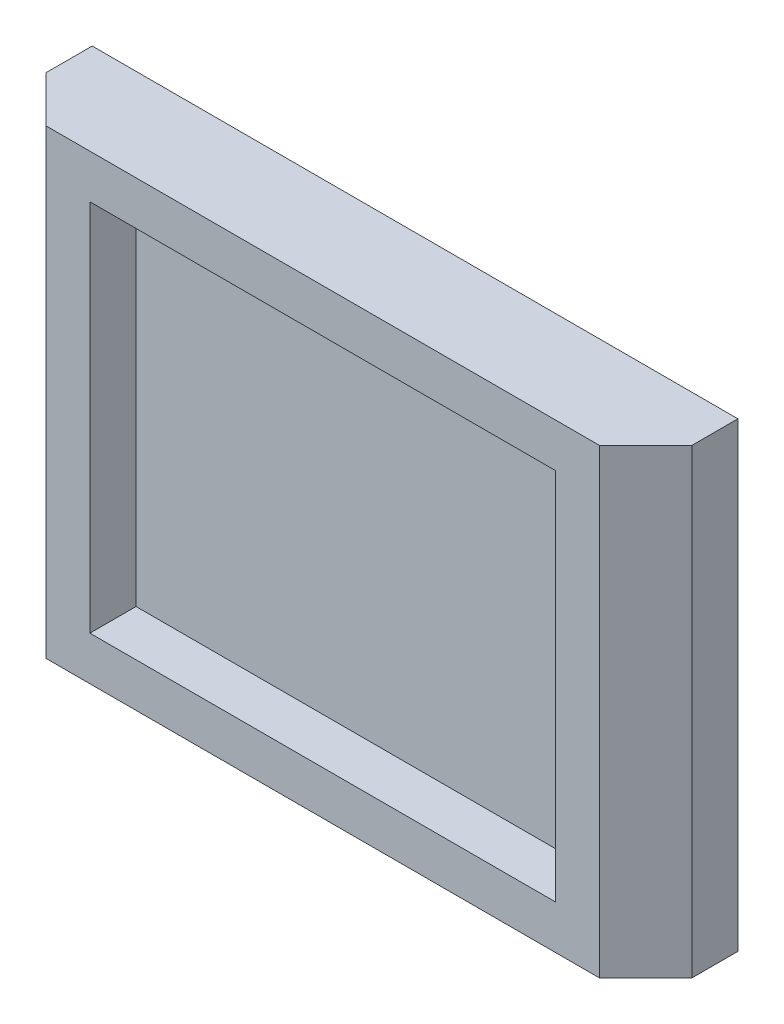
ISO-10303-21;
HEADER;
FILE_DESCRIPTION(('STEP AP214'),'2;1');
FILE_NAME('part.step','',(''),(''),'','','');
FILE_SCHEMA(('AUTOMOTIVE_DESIGN { 1 0 10303 214 1 1 1 1 }'));
ENDSEC;
DATA;
#1=APPLICATION_CONTEXT('core data for automotive mechanical design processes');
#2=APPLICATION_PROTOCOL_DEFINITION('international standard','automotive_design',2000,#1);
#3=PRODUCT_CONTEXT('',#1,'mechanical');
#4=PRODUCT('Part','Part','',(#3));
#5=PRODUCT_RELATED_PRODUCT_CATEGORY('part','',(#4));
#6=PRODUCT_DEFINITION_FORMATION('','',#4);
#7=PRODUCT_DEFINITION_CONTEXT('part definition',#1,'design');
#8=PRODUCT_DEFINITION('design','',#6,#7);
#9=PRODUCT_DEFINITION_SHAPE('','',#8);
#10=(LENGTH_UNIT() NAMED_UNIT(*) SI_UNIT(.MILLI.,.METRE.));
#11=(NAMED_UNIT(*) PLANE_ANGLE_UNIT() SI_UNIT($,.RADIAN.));
#12=(NAMED_UNIT(*) SI_UNIT($,.STERADIAN.) SOLID_ANGLE_UNIT());
#13=UNCERTAINTY_MEASURE_WITH_UNIT(LENGTH_MEASURE(1.E-05),#10,'distance_accuracy_value','');
#14=(GEOMETRIC_REPRESENTATION_CONTEXT(3) GLOBAL_UNCERTAINTY_ASSIGNED_CONTEXT((#13)) GLOBAL_UNIT_ASSIGNED_CONTEXT((#10,
#11,#12)) REPRESENTATION_CONTEXT('',''));
#15=CARTESIAN_POINT('',(0.,0.,0.));
#16=DIRECTION('',(0.,0.,1.));
#17=DIRECTION('',(1.,0.,0.));
#18=AXIS2_PLACEMENT_3D('',#15,#16,#17);
#19=CARTESIAN_POINT('',(-35.,25.,10.));
#20=DIRECTION('',(1.,0.,0.));
#21=DIRECTION('',(0.,1.,0.));
#22=AXIS2_PLACEMENT_3D('',#19,#20,#21);
#23=PLANE('',#22);
#24=DIRECTION('',(0.,0.,-1.));
#25=VECTOR('',#24,1.);
#26=CARTESIAN_POINT('',(-35.,-25.,10.));
#27=LINE('',#26,#25);
#28=CARTESIAN_POINT('',(-35.,-25.,4.99999999999997));
#29=VERTEX_POINT('',#28);
#30=CARTESIAN_POINT('',(-35.,-25.,0.));
#31=VERTEX_POINT('',#30);
#32=EDGE_CURVE('E207',#29,#31,#27,.T.);
#33=ORIENTED_EDGE('',*,*,#32,.F.);
#34=DIRECTION('',(0.,1.,0.));
#35=VECTOR('',#34,1.);
#36=CARTESIAN_POINT('',(-35.,25.,4.99999999999997));
#37=LINE('',#36,#35);
#38=CARTESIAN_POINT('',(-35.,25.,4.99999999999997));
#39=VERTEX_POINT('',#38);
#40=EDGE_CURVE('E66',#29,#39,#37,.T.);
#41=ORIENTED_EDGE('',*,*,#40,.T.);
#42=DIRECTION('',(0.,0.,-1.));
#43=VECTOR('',#42,1.);
#44=CARTESIAN_POINT('',(-35.,25.,10.));
#45=LINE('',#44,#43);
#46=CARTESIAN_POINT('',(-35.,25.,0.));
#47=VERTEX_POINT('',#46);
#48=EDGE_CURVE('E184',#39,#47,#45,.T.);
#49=ORIENTED_EDGE('',*,*,#48,.T.);
#50=DIRECTION('',(0.,-1.,0.));
#51=VECTOR('',#50,1.);
#52=CARTESIAN_POINT('',(-35.,25.,0.));
#53=LINE('',#52,#51);
#54=EDGE_CURVE('E169',#47,#31,#53,.T.);
#55=ORIENTED_EDGE('',*,*,#54,.T.);
#56=EDGE_LOOP('',(#33,#41,#49,#55));
#57=FACE_BOUND('',#56,.T.);
#58=ADVANCED_FACE('F41',(#57),#23,.F.);
#59=CARTESIAN_POINT('',(-35.,-25.,10.));
#60=DIRECTION('',(0.,1.,0.));
#61=DIRECTION('',(-1.,0.,0.));
#62=AXIS2_PLACEMENT_3D('',#59,#60,#61);
#63=PLANE('',#62);
#64=DIRECTION('',(1.,0.,0.));
#65=VECTOR('',#64,1.);
#66=CARTESIAN_POINT('',(-35.,-25.,10.));
#67=LINE('',#66,#65);
#68=CARTESIAN_POINT('',(-30.,-25.,10.));
#69=VERTEX_POINT('',#68);
#70=CARTESIAN_POINT('',(30.,-25.,10.));
#71=VERTEX_POINT('',#70);
#72=EDGE_CURVE('E175',#69,#71,#67,.T.);
#73=ORIENTED_EDGE('',*,*,#72,.F.);
#74=DIRECTION('',(-0.707106781186546,0.,-0.707106781186549));
#75=VECTOR('',#74,1.);
#76=CARTESIAN_POINT('',(-30.,-25.,10.));
#77=LINE('',#76,#75);
#78=EDGE_CURVE('E221',#69,#29,#77,.T.);
#79=ORIENTED_EDGE('',*,*,#78,.T.);
#80=ORIENTED_EDGE('',*,*,#32,.T.);
#81=DIRECTION('',(1.,0.,0.));
#82=VECTOR('',#81,1.);
#83=CARTESIAN_POINT('',(-35.,-25.,0.));
#84=LINE('',#83,#82);
#85=CARTESIAN_POINT('',(35.,-25.,0.));
#86=VERTEX_POINT('',#85);
#87=EDGE_CURVE('E188',#31,#86,#84,.T.);
#88=ORIENTED_EDGE('',*,*,#87,.T.);
#89=DIRECTION('',(0.,0.,-1.));
#90=VECTOR('',#89,1.);
#91=CARTESIAN_POINT('',(35.,-25.,10.));
#92=LINE('',#91,#90);
#93=CARTESIAN_POINT('',(35.,-25.,4.99999999999997));
#94=VERTEX_POINT('',#93);
#95=EDGE_CURVE('E204',#94,#86,#92,.T.);
#96=ORIENTED_EDGE('',*,*,#95,.F.);
#97=DIRECTION('',(-0.707106781186546,0.,0.707106781186549));
#98=VECTOR('',#97,1.);
#99=CARTESIAN_POINT('',(30.,-25.,10.));
#100=LINE('',#99,#98);
#101=EDGE_CURVE('E218',#94,#71,#100,.T.);
#102=ORIENTED_EDGE('',*,*,#101,.T.);
#103=EDGE_LOOP('',(#73,#79,#80,#88,#96,#102));
#104=FACE_BOUND('',#103,.T.);
#105=ADVANCED_FACE('F238',(#104),#63,.F.);
#106=CARTESIAN_POINT('',(35.,25.,10.));
#107=DIRECTION('',(-1.,0.,0.));
#108=DIRECTION('',(0.,-1.,0.));
#109=AXIS2_PLACEMENT_3D('',#106,#107,#108);
#110=PLANE('',#109);
#111=DIRECTION('',(0.,0.,-1.));
#112=VECTOR('',#111,1.);
#113=CARTESIAN_POINT('',(35.,25.,10.));
#114=LINE('',#113,#112);
#115=CARTESIAN_POINT('',(35.,25.,4.99999999999997));
#116=VERTEX_POINT('',#115);
#117=CARTESIAN_POINT('',(35.,25.,0.));
#118=VERTEX_POINT('',#117);
#119=EDGE_CURVE('E201',#116,#118,#114,.T.);
#120=ORIENTED_EDGE('',*,*,#119,.F.);
#121=DIRECTION('',(0.,-1.,0.));
#122=VECTOR('',#121,1.);
#123=CARTESIAN_POINT('',(35.,-25.,4.99999999999997));
#124=LINE('',#123,#122);
#125=EDGE_CURVE('E11',#116,#94,#124,.T.);
#126=ORIENTED_EDGE('',*,*,#125,.T.);
#127=ORIENTED_EDGE('',*,*,#95,.T.);
#128=DIRECTION('',(0.,1.,0.));
#129=VECTOR('',#128,1.);
#130=CARTESIAN_POINT('',(35.,25.,0.));
#131=LINE('',#130,#129);
#132=EDGE_CURVE('E192',#86,#118,#131,.T.);
#133=ORIENTED_EDGE('',*,*,#132,.T.);
#134=EDGE_LOOP('',(#120,#126,#127,#133));
#135=FACE_BOUND('',#134,.T.);
#136=ADVANCED_FACE('F250',(#135),#110,.F.);
#137=CARTESIAN_POINT('',(-35.,25.,10.));
#138=DIRECTION('',(0.,-1.,0.));
#139=DIRECTION('',(1.,0.,0.));
#140=AXIS2_PLACEMENT_3D('',#137,#138,#139);
#141=PLANE('',#140);
#142=ORIENTED_EDGE('',*,*,#48,.F.);
#143=DIRECTION('',(0.707106781186546,0.,0.707106781186549));
#144=VECTOR('',#143,1.);
#145=CARTESIAN_POINT('',(-30.,25.,10.));
#146=LINE('',#145,#144);
#147=CARTESIAN_POINT('',(-30.,25.,10.));
#148=VERTEX_POINT('',#147);
#149=EDGE_CURVE('E51',#39,#148,#146,.T.);
#150=ORIENTED_EDGE('',*,*,#149,.T.);
#151=DIRECTION('',(-1.,0.,0.));
#152=VECTOR('',#151,1.);
#153=CARTESIAN_POINT('',(-35.,25.,10.));
#154=LINE('',#153,#152);
#155=CARTESIAN_POINT('',(30.,25.,10.));
#156=VERTEX_POINT('',#155);
#157=EDGE_CURVE('E179',#156,#148,#154,.T.);
#158=ORIENTED_EDGE('',*,*,#157,.F.);
#159=DIRECTION('',(0.707106781186546,0.,-0.707106781186549));
#160=VECTOR('',#159,1.);
#161=CARTESIAN_POINT('',(30.,25.,9.99999999999999));
#162=LINE('',#161,#160);
#163=EDGE_CURVE('E58',#156,#116,#162,.T.);
#164=ORIENTED_EDGE('',*,*,#163,.T.);
#165=ORIENTED_EDGE('',*,*,#119,.T.);
#166=DIRECTION('',(-1.,0.,0.));
#167=VECTOR('',#166,1.);
#168=CARTESIAN_POINT('',(-35.,25.,0.));
#169=LINE('',#168,#167);
#170=EDGE_CURVE('E180',#118,#47,#169,.T.);
#171=ORIENTED_EDGE('',*,*,#170,.T.);
#172=EDGE_LOOP('',(#142,#150,#158,#164,#165,#171));
#173=FACE_BOUND('',#172,.T.);
#174=ADVANCED_FACE('F229',(#173),#141,.F.);
#175=CARTESIAN_POINT('',(0.,0.,10.));
#176=DIRECTION('',(0.,0.,1.));
#177=DIRECTION('',(1.,0.,0.));
#178=AXIS2_PLACEMENT_3D('',#175,#176,#177);
#179=PLANE('',#178);
#180=DIRECTION('',(0.,-1.,0.));
#181=VECTOR('',#180,1.);
#182=CARTESIAN_POINT('',(-25.25,20.25,10.));
#183=LINE('',#182,#181);
#184=CARTESIAN_POINT('',(-25.25,20.25,10.));
#185=VERTEX_POINT('',#184);
#186=CARTESIAN_POINT('',(-25.25,-20.25,10.));
#187=VERTEX_POINT('',#186);
#188=EDGE_CURVE('E127',#185,#187,#183,.T.);
#189=ORIENTED_EDGE('',*,*,#188,.F.);
#190=DIRECTION('',(-1.,0.,0.));
#191=VECTOR('',#190,1.);
#192=CARTESIAN_POINT('',(-25.25,20.25,10.));
#193=LINE('',#192,#191);
#194=CARTESIAN_POINT('',(25.25,20.25,10.));
#195=VERTEX_POINT('',#194);
#196=EDGE_CURVE('E147',#195,#185,#193,.T.);
#197=ORIENTED_EDGE('',*,*,#196,.F.);
#198=DIRECTION('',(0.,1.,0.));
#199=VECTOR('',#198,1.);
#200=CARTESIAN_POINT('',(25.25,20.25,10.));
#201=LINE('',#200,#199);
#202=CARTESIAN_POINT('',(25.25,-20.25,10.));
#203=VERTEX_POINT('',#202);
#204=EDGE_CURVE('E151',#203,#195,#201,.T.);
#205=ORIENTED_EDGE('',*,*,#204,.F.);
#206=DIRECTION('',(1.,0.,0.));
#207=VECTOR('',#206,1.);
#208=CARTESIAN_POINT('',(-25.25,-20.25,10.));
#209=LINE('',#208,#207);
#210=EDGE_CURVE('E160',#187,#203,#209,.T.);
#211=ORIENTED_EDGE('',*,*,#210,.F.);
#212=EDGE_LOOP('',(#189,#197,#205,#211));
#213=FACE_BOUND('',#212,.T.);
#214=ORIENTED_EDGE('',*,*,#157,.T.);
#215=DIRECTION('',(0.,-1.,0.));
#216=VECTOR('',#215,1.);
#217=CARTESIAN_POINT('',(-30.,-25.,10.));
#218=LINE('',#217,#216);
#219=EDGE_CURVE('E214',#148,#69,#218,.T.);
#220=ORIENTED_EDGE('',*,*,#219,.T.);
#221=ORIENTED_EDGE('',*,*,#72,.T.);
#222=DIRECTION('',(0.,1.,0.));
#223=VECTOR('',#222,1.);
#224=CARTESIAN_POINT('',(30.,25.,10.));
#225=LINE('',#224,#223);
#226=EDGE_CURVE('E210',#71,#156,#225,.T.);
#227=ORIENTED_EDGE('',*,*,#226,.T.);
#228=EDGE_LOOP('',(#214,#220,#221,#227));
#229=FACE_BOUND('',#228,.T.);
#230=ADVANCED_FACE('F233',(#213,#229),#179,.T.);
#231=CARTESIAN_POINT('',(0.,0.,0.));
#232=DIRECTION('',(0.,0.,1.));
#233=DIRECTION('',(1.,0.,0.));
#234=AXIS2_PLACEMENT_3D('',#231,#232,#233);
#235=PLANE('',#234);
#236=ORIENTED_EDGE('',*,*,#54,.F.);
#237=ORIENTED_EDGE('',*,*,#170,.F.);
#238=ORIENTED_EDGE('',*,*,#132,.F.);
#239=ORIENTED_EDGE('',*,*,#87,.F.);
#240=EDGE_LOOP('',(#236,#237,#238,#239));
#241=FACE_BOUND('',#240,.T.);
#242=ADVANCED_FACE('F243',(#241),#235,.F.);
#243=CARTESIAN_POINT('',(-25.25,20.25,5.));
#244=DIRECTION('',(-1.,0.,0.));
#245=DIRECTION('',(0.,-1.,0.));
#246=AXIS2_PLACEMENT_3D('',#243,#244,#245);
#247=PLANE('',#246);
#248=ORIENTED_EDGE('',*,*,#188,.T.);
#249=DIRECTION('',(0.,0.,1.));
#250=VECTOR('',#249,1.);
#251=CARTESIAN_POINT('',(-25.25,-20.25,5.));
#252=LINE('',#251,#250);
#253=CARTESIAN_POINT('',(-25.25,-20.25,5.));
#254=VERTEX_POINT('',#253);
#255=EDGE_CURVE('E120',#254,#187,#252,.T.);
#256=ORIENTED_EDGE('',*,*,#255,.F.);
#257=DIRECTION('',(0.,-1.,0.));
#258=VECTOR('',#257,1.);
#259=CARTESIAN_POINT('',(-25.25,20.25,5.));
#260=LINE('',#259,#258);
#261=CARTESIAN_POINT('',(-25.25,20.25,5.));
#262=VERTEX_POINT('',#261);
#263=EDGE_CURVE('E124',#262,#254,#260,.T.);
#264=ORIENTED_EDGE('',*,*,#263,.F.);
#265=DIRECTION('',(0.,0.,1.));
#266=VECTOR('',#265,1.);
#267=CARTESIAN_POINT('',(-25.25,20.25,5.));
#268=LINE('',#267,#266);
#269=EDGE_CURVE('E166',#262,#185,#268,.T.);
#270=ORIENTED_EDGE('',*,*,#269,.T.);
#271=EDGE_LOOP('',(#248,#256,#264,#270));
#272=FACE_BOUND('',#271,.T.);
#273=ADVANCED_FACE('F122',(#272),#247,.F.);
#274=CARTESIAN_POINT('',(-25.25,20.25,5.));
#275=DIRECTION('',(0.,1.,0.));
#276=DIRECTION('',(-1.,0.,0.));
#277=AXIS2_PLACEMENT_3D('',#274,#275,#276);
#278=PLANE('',#277);
#279=ORIENTED_EDGE('',*,*,#196,.T.);
#280=ORIENTED_EDGE('',*,*,#269,.F.);
#281=DIRECTION('',(-1.,0.,0.));
#282=VECTOR('',#281,1.);
#283=CARTESIAN_POINT('',(-25.25,20.25,5.));
#284=LINE('',#283,#282);
#285=CARTESIAN_POINT('',(25.25,20.25,5.));
#286=VERTEX_POINT('',#285);
#287=EDGE_CURVE('E133',#286,#262,#284,.T.);
#288=ORIENTED_EDGE('',*,*,#287,.F.);
#289=DIRECTION('',(0.,0.,1.));
#290=VECTOR('',#289,1.);
#291=CARTESIAN_POINT('',(25.25,20.25,5.));
#292=LINE('',#291,#290);
#293=EDGE_CURVE('E170',#286,#195,#292,.T.);
#294=ORIENTED_EDGE('',*,*,#293,.T.);
#295=EDGE_LOOP('',(#279,#280,#288,#294));
#296=FACE_BOUND('',#295,.T.);
#297=ADVANCED_FACE('F278',(#296),#278,.F.);
#298=CARTESIAN_POINT('',(25.25,20.25,5.));
#299=DIRECTION('',(1.,0.,0.));
#300=DIRECTION('',(0.,1.,0.));
#301=AXIS2_PLACEMENT_3D('',#298,#299,#300);
#302=PLANE('',#301);
#303=ORIENTED_EDGE('',*,*,#204,.T.);
#304=ORIENTED_EDGE('',*,*,#293,.F.);
#305=DIRECTION('',(0.,1.,0.));
#306=VECTOR('',#305,1.);
#307=CARTESIAN_POINT('',(25.25,20.25,5.));
#308=LINE('',#307,#306);
#309=CARTESIAN_POINT('',(25.25,-20.25,5.));
#310=VERTEX_POINT('',#309);
#311=EDGE_CURVE('E142',#310,#286,#308,.T.);
#312=ORIENTED_EDGE('',*,*,#311,.F.);
#313=DIRECTION('',(0.,0.,1.));
#314=VECTOR('',#313,1.);
#315=CARTESIAN_POINT('',(25.25,-20.25,5.));
#316=LINE('',#315,#314);
#317=EDGE_CURVE('E132',#310,#203,#316,.T.);
#318=ORIENTED_EDGE('',*,*,#317,.T.);
#319=EDGE_LOOP('',(#303,#304,#312,#318));
#320=FACE_BOUND('',#319,.T.);
#321=ADVANCED_FACE('F275',(#320),#302,.F.);
#322=CARTESIAN_POINT('',(-25.25,-20.25,5.));
#323=DIRECTION('',(0.,-1.,0.));
#324=DIRECTION('',(1.,0.,0.));
#325=AXIS2_PLACEMENT_3D('',#322,#323,#324);
#326=PLANE('',#325);
#327=ORIENTED_EDGE('',*,*,#210,.T.);
#328=ORIENTED_EDGE('',*,*,#317,.F.);
#329=DIRECTION('',(1.,0.,0.));
#330=VECTOR('',#329,1.);
#331=CARTESIAN_POINT('',(-25.25,-20.25,5.));
#332=LINE('',#331,#330);
#333=EDGE_CURVE('E136',#254,#310,#332,.T.);
#334=ORIENTED_EDGE('',*,*,#333,.F.);
#335=ORIENTED_EDGE('',*,*,#255,.T.);
#336=EDGE_LOOP('',(#327,#328,#334,#335));
#337=FACE_BOUND('',#336,.T.);
#338=ADVANCED_FACE('F137',(#337),#326,.F.);
#339=CARTESIAN_POINT('',(0.,0.,5.));
#340=DIRECTION('',(0.,0.,1.));
#341=DIRECTION('',(1.,0.,0.));
#342=AXIS2_PLACEMENT_3D('',#339,#340,#341);
#343=PLANE('',#342);
#344=ORIENTED_EDGE('',*,*,#263,.T.);
#345=ORIENTED_EDGE('',*,*,#333,.T.);
#346=ORIENTED_EDGE('',*,*,#311,.T.);
#347=ORIENTED_EDGE('',*,*,#287,.T.);
#348=EDGE_LOOP('',(#344,#345,#346,#347));
#349=FACE_BOUND('',#348,.T.);
#350=ADVANCED_FACE('F144',(#349),#343,.T.);
#351=CARTESIAN_POINT('',(-30.,0.,10.));
#352=DIRECTION('',(-0.707106781186549,0.,0.707106781186546));
#353=DIRECTION('',(0.,1.,0.));
#354=AXIS2_PLACEMENT_3D('',#351,#352,#353);
#355=PLANE('',#354);
#356=ORIENTED_EDGE('',*,*,#149,.F.);
#357=ORIENTED_EDGE('',*,*,#40,.F.);
#358=ORIENTED_EDGE('',*,*,#78,.F.);
#359=ORIENTED_EDGE('',*,*,#219,.F.);
#360=EDGE_LOOP('',(#356,#357,#358,#359));
#361=FACE_BOUND('',#360,.T.);
#362=ADVANCED_FACE('F236',(#361),#355,.T.);
#363=CARTESIAN_POINT('',(30.,0.,10.));
#364=DIRECTION('',(0.707106781186549,0.,0.707106781186546));
#365=DIRECTION('',(0.,-1.,0.));
#366=AXIS2_PLACEMENT_3D('',#363,#364,#365);
#367=PLANE('',#366);
#368=ORIENTED_EDGE('',*,*,#101,.F.);
#369=ORIENTED_EDGE('',*,*,#125,.F.);
#370=ORIENTED_EDGE('',*,*,#163,.F.);
#371=ORIENTED_EDGE('',*,*,#226,.F.);
#372=EDGE_LOOP('',(#368,#369,#370,#371));
#373=FACE_BOUND('',#372,.T.);
#374=ADVANCED_FACE('F44',(#373),#367,.T.);
#375=CLOSED_SHELL('',(#58,#105,#136,#174,#230,#242,#273,#297,#321,#338,#350,#362,#374));
#376=MANIFOLD_SOLID_BREP('B2',#375);
#377=ADVANCED_BREP_SHAPE_REPRESENTATION('',(#18,#376),#14);
#378=SHAPE_DEFINITION_REPRESENTATION(#9,#377);
ENDSEC;
END-ISO-10303-21;
